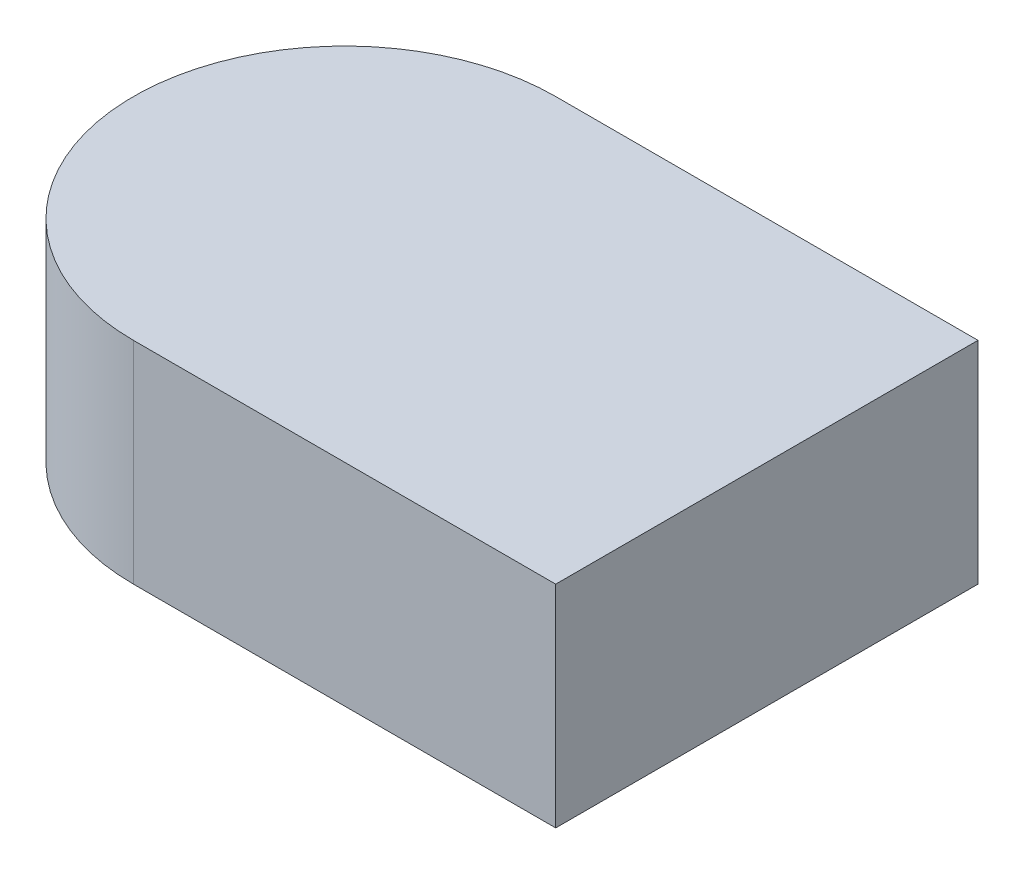
ISO-10303-21;
HEADER;
FILE_DESCRIPTION(('STEP AP214'),'2;1');
FILE_NAME('part.step','',(''),(''),'','','');
FILE_SCHEMA(('AUTOMOTIVE_DESIGN { 1 0 10303 214 1 1 1 1 }'));
ENDSEC;
DATA;
#1=APPLICATION_CONTEXT('core data for automotive mechanical design processes');
#2=APPLICATION_PROTOCOL_DEFINITION('international standard','automotive_design',2000,#1);
#3=PRODUCT_CONTEXT('',#1,'mechanical');
#4=PRODUCT('Part','Part','',(#3));
#5=PRODUCT_RELATED_PRODUCT_CATEGORY('part','',(#4));
#6=PRODUCT_DEFINITION_FORMATION('','',#4);
#7=PRODUCT_DEFINITION_CONTEXT('part definition',#1,'design');
#8=PRODUCT_DEFINITION('design','',#6,#7);
#9=PRODUCT_DEFINITION_SHAPE('','',#8);
#10=(LENGTH_UNIT() NAMED_UNIT(*) SI_UNIT(.MILLI.,.METRE.));
#11=(NAMED_UNIT(*) PLANE_ANGLE_UNIT() SI_UNIT($,.RADIAN.));
#12=(NAMED_UNIT(*) SI_UNIT($,.STERADIAN.) SOLID_ANGLE_UNIT());
#13=UNCERTAINTY_MEASURE_WITH_UNIT(LENGTH_MEASURE(1.E-05),#10,'distance_accuracy_value','');
#14=(GEOMETRIC_REPRESENTATION_CONTEXT(3) GLOBAL_UNCERTAINTY_ASSIGNED_CONTEXT((#13)) GLOBAL_UNIT_ASSIGNED_CONTEXT((#10,
#11,#12)) REPRESENTATION_CONTEXT('',''));
#15=CARTESIAN_POINT('',(0.,0.,0.));
#16=DIRECTION('',(0.,0.,1.));
#17=DIRECTION('',(1.,0.,0.));
#18=AXIS2_PLACEMENT_3D('',#15,#16,#17);
#19=CARTESIAN_POINT('',(0.,0.,0.));
#20=DIRECTION('',(0.,1.,0.));
#21=DIRECTION('',(1.,0.,0.));
#22=AXIS2_PLACEMENT_3D('',#19,#20,#21);
#23=PLANE('',#22);
#24=DIRECTION('',(0.,0.,-1.));
#25=VECTOR('',#24,1.);
#26=CARTESIAN_POINT('',(1.25,0.,-1.3));
#27=LINE('',#26,#25);
#28=CARTESIAN_POINT('',(1.25,0.,-1.3));
#29=VERTEX_POINT('',#28);
#30=CARTESIAN_POINT('',(1.25,0.,-1.5));
#31=VERTEX_POINT('',#30);
#32=EDGE_CURVE('E11',#29,#31,#27,.T.);
#33=ORIENTED_EDGE('',*,*,#32,.F.);
#34=DIRECTION('',(1.,0.,0.));
#35=VECTOR('',#34,1.);
#36=CARTESIAN_POINT('',(1.05,0.,-1.3));
#37=LINE('',#36,#35);
#38=CARTESIAN_POINT('',(1.05,0.,-1.3));
#39=VERTEX_POINT('',#38);
#40=EDGE_CURVE('E25',#39,#29,#37,.T.);
#41=ORIENTED_EDGE('',*,*,#40,.F.);
#42=CARTESIAN_POINT('',(1.05,0.,-1.4));
#43=DIRECTION('',(0.,1.,0.));
#44=DIRECTION('',(0.,0.,-1.));
#45=AXIS2_PLACEMENT_3D('',#42,#43,#44);
#46=CIRCLE('',#45,0.1);
#47=CARTESIAN_POINT('',(1.05,0.,-1.5));
#48=VERTEX_POINT('',#47);
#49=EDGE_CURVE('E73',#48,#39,#46,.T.);
#50=ORIENTED_EDGE('',*,*,#49,.F.);
#51=DIRECTION('',(-1.,0.,0.));
#52=VECTOR('',#51,1.);
#53=CARTESIAN_POINT('',(1.25,0.,-1.5));
#54=LINE('',#53,#52);
#55=EDGE_CURVE('E99',#31,#48,#54,.T.);
#56=ORIENTED_EDGE('',*,*,#55,.F.);
#57=EDGE_LOOP('',(#33,#41,#50,#56));
#58=FACE_BOUND('',#57,.T.);
#59=ADVANCED_FACE('F17',(#58),#23,.F.);
#60=CARTESIAN_POINT('',(1.25,0.,-1.5));
#61=DIRECTION('',(0.,0.,-1.));
#62=DIRECTION('',(-1.,0.,0.));
#63=AXIS2_PLACEMENT_3D('',#60,#61,#62);
#64=PLANE('',#63);
#65=DIRECTION('',(0.,1.,0.));
#66=VECTOR('',#65,1.);
#67=CARTESIAN_POINT('',(1.05,0.,-1.5));
#68=LINE('',#67,#66);
#69=CARTESIAN_POINT('',(1.05,0.1,-1.5));
#70=VERTEX_POINT('',#69);
#71=EDGE_CURVE('E95',#48,#70,#68,.T.);
#72=ORIENTED_EDGE('',*,*,#71,.T.);
#73=DIRECTION('',(-1.,0.,0.));
#74=VECTOR('',#73,1.);
#75=CARTESIAN_POINT('',(1.25,0.1,-1.5));
#76=LINE('',#75,#74);
#77=CARTESIAN_POINT('',(1.25,0.1,-1.5));
#78=VERTEX_POINT('',#77);
#79=EDGE_CURVE('E68',#78,#70,#76,.T.);
#80=ORIENTED_EDGE('',*,*,#79,.F.);
#81=DIRECTION('',(0.,1.,0.));
#82=VECTOR('',#81,1.);
#83=CARTESIAN_POINT('',(1.25,0.,-1.5));
#84=LINE('',#83,#82);
#85=EDGE_CURVE('E87',#31,#78,#84,.T.);
#86=ORIENTED_EDGE('',*,*,#85,.F.);
#87=ORIENTED_EDGE('',*,*,#55,.T.);
#88=EDGE_LOOP('',(#72,#80,#86,#87));
#89=FACE_BOUND('',#88,.T.);
#90=ADVANCED_FACE('F113',(#89),#64,.T.);
#91=CARTESIAN_POINT('',(1.25,0.,-1.3));
#92=DIRECTION('',(1.,0.,0.));
#93=DIRECTION('',(0.,0.,-1.));
#94=AXIS2_PLACEMENT_3D('',#91,#92,#93);
#95=PLANE('',#94);
#96=ORIENTED_EDGE('',*,*,#85,.T.);
#97=DIRECTION('',(0.,0.,-1.));
#98=VECTOR('',#97,1.);
#99=CARTESIAN_POINT('',(1.25,0.1,-1.3));
#100=LINE('',#99,#98);
#101=CARTESIAN_POINT('',(1.25,0.1,-1.3));
#102=VERTEX_POINT('',#101);
#103=EDGE_CURVE('E83',#102,#78,#100,.T.);
#104=ORIENTED_EDGE('',*,*,#103,.F.);
#105=DIRECTION('',(0.,1.,0.));
#106=VECTOR('',#105,1.);
#107=CARTESIAN_POINT('',(1.25,0.,-1.3));
#108=LINE('',#107,#106);
#109=EDGE_CURVE('E60',#29,#102,#108,.T.);
#110=ORIENTED_EDGE('',*,*,#109,.F.);
#111=ORIENTED_EDGE('',*,*,#32,.T.);
#112=EDGE_LOOP('',(#96,#104,#110,#111));
#113=FACE_BOUND('',#112,.T.);
#114=ADVANCED_FACE('F119',(#113),#95,.T.);
#115=CARTESIAN_POINT('',(1.05,0.,-1.3));
#116=DIRECTION('',(0.,0.,1.));
#117=DIRECTION('',(1.,0.,0.));
#118=AXIS2_PLACEMENT_3D('',#115,#116,#117);
#119=PLANE('',#118);
#120=ORIENTED_EDGE('',*,*,#109,.T.);
#121=DIRECTION('',(1.,0.,0.));
#122=VECTOR('',#121,1.);
#123=CARTESIAN_POINT('',(1.05,0.1,-1.3));
#124=LINE('',#123,#122);
#125=CARTESIAN_POINT('',(1.05,0.1,-1.3));
#126=VERTEX_POINT('',#125);
#127=EDGE_CURVE('E54',#126,#102,#124,.T.);
#128=ORIENTED_EDGE('',*,*,#127,.F.);
#129=DIRECTION('',(0.,1.,0.));
#130=VECTOR('',#129,1.);
#131=CARTESIAN_POINT('',(1.05,0.,-1.3));
#132=LINE('',#131,#130);
#133=EDGE_CURVE('E58',#39,#126,#132,.T.);
#134=ORIENTED_EDGE('',*,*,#133,.F.);
#135=ORIENTED_EDGE('',*,*,#40,.T.);
#136=EDGE_LOOP('',(#120,#128,#134,#135));
#137=FACE_BOUND('',#136,.T.);
#138=ADVANCED_FACE('F56',(#137),#119,.T.);
#139=CARTESIAN_POINT('',(1.05,0.,-1.4));
#140=DIRECTION('',(0.,1.,0.));
#141=DIRECTION('',(1.,0.,0.));
#142=AXIS2_PLACEMENT_3D('',#139,#140,#141);
#143=CYLINDRICAL_SURFACE('',#142,0.1);
#144=ORIENTED_EDGE('',*,*,#133,.T.);
#145=CARTESIAN_POINT('',(1.05,0.1,-1.4));
#146=DIRECTION('',(0.,1.,0.));
#147=DIRECTION('',(0.,0.,-1.));
#148=AXIS2_PLACEMENT_3D('',#145,#146,#147);
#149=CIRCLE('',#148,0.1);
#150=EDGE_CURVE('E66',#70,#126,#149,.T.);
#151=ORIENTED_EDGE('',*,*,#150,.F.);
#152=ORIENTED_EDGE('',*,*,#71,.F.);
#153=ORIENTED_EDGE('',*,*,#49,.T.);
#154=EDGE_LOOP('',(#144,#151,#152,#153));
#155=FACE_BOUND('',#154,.T.);
#156=ADVANCED_FACE('F72',(#155),#143,.T.);
#157=CARTESIAN_POINT('',(0.,0.1,0.));
#158=DIRECTION('',(0.,1.,0.));
#159=DIRECTION('',(1.,0.,0.));
#160=AXIS2_PLACEMENT_3D('',#157,#158,#159);
#161=PLANE('',#160);
#162=ORIENTED_EDGE('',*,*,#150,.T.);
#163=ORIENTED_EDGE('',*,*,#127,.T.);
#164=ORIENTED_EDGE('',*,*,#103,.T.);
#165=ORIENTED_EDGE('',*,*,#79,.T.);
#166=EDGE_LOOP('',(#162,#163,#164,#165));
#167=FACE_BOUND('',#166,.T.);
#168=ADVANCED_FACE('F67',(#167),#161,.T.);
#169=CLOSED_SHELL('',(#59,#90,#114,#138,#156,#168));
#170=MANIFOLD_SOLID_BREP('B1',#169);
#171=ADVANCED_BREP_SHAPE_REPRESENTATION('',(#18,#170),#14);
#172=SHAPE_DEFINITION_REPRESENTATION(#9,#171);
ENDSEC;
END-ISO-10303-21;
